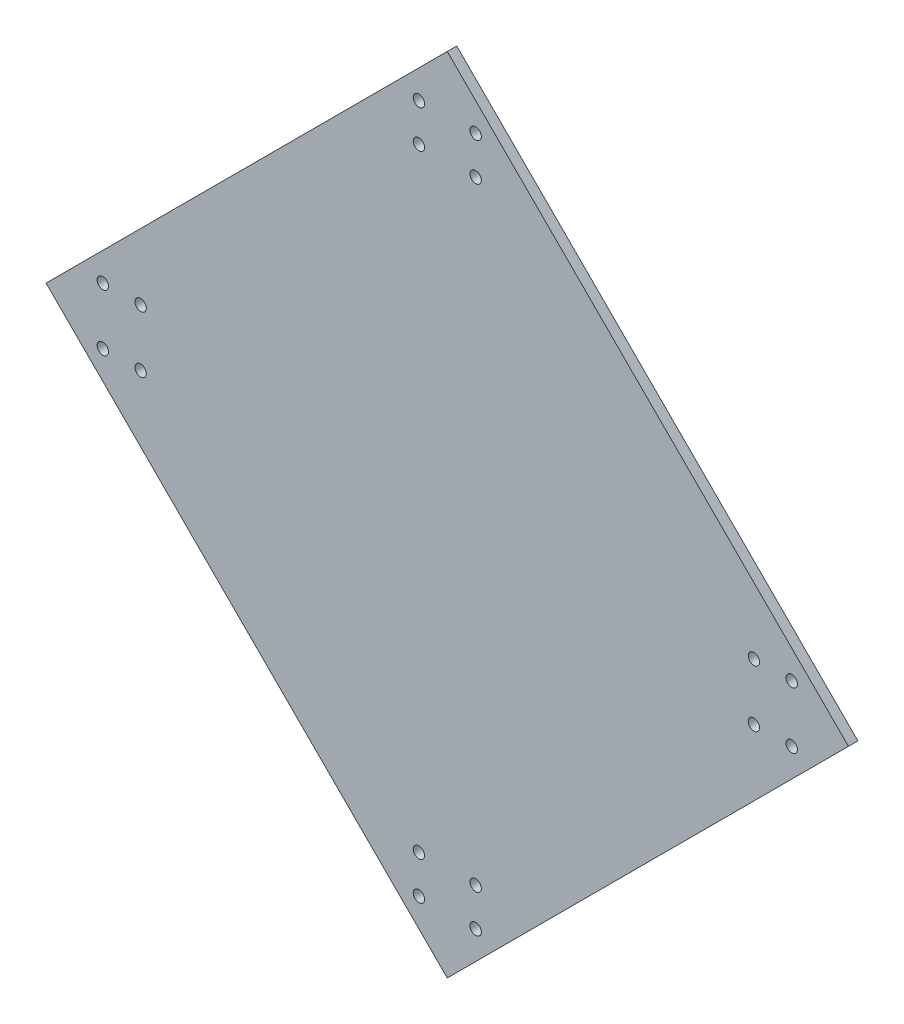
ISO-10303-21;
HEADER;
FILE_DESCRIPTION(('STEP AP214'),'2;1');
FILE_NAME('part.step','',(''),(''),'','','');
FILE_SCHEMA(('AUTOMOTIVE_DESIGN { 1 0 10303 214 1 1 1 1 }'));
ENDSEC;
DATA;
#1=APPLICATION_CONTEXT('core data for automotive mechanical design processes');
#2=APPLICATION_PROTOCOL_DEFINITION('international standard','automotive_design',2000,#1);
#3=PRODUCT_CONTEXT('',#1,'mechanical');
#4=PRODUCT('Part','Part','',(#3));
#5=PRODUCT_RELATED_PRODUCT_CATEGORY('part','',(#4));
#6=PRODUCT_DEFINITION_FORMATION('','',#4);
#7=PRODUCT_DEFINITION_CONTEXT('part definition',#1,'design');
#8=PRODUCT_DEFINITION('design','',#6,#7);
#9=PRODUCT_DEFINITION_SHAPE('','',#8);
#10=(LENGTH_UNIT() NAMED_UNIT(*) SI_UNIT(.MILLI.,.METRE.));
#11=(NAMED_UNIT(*) PLANE_ANGLE_UNIT() SI_UNIT($,.RADIAN.));
#12=(NAMED_UNIT(*) SI_UNIT($,.STERADIAN.) SOLID_ANGLE_UNIT());
#13=UNCERTAINTY_MEASURE_WITH_UNIT(LENGTH_MEASURE(1.E-05),#10,'distance_accuracy_value','');
#14=(GEOMETRIC_REPRESENTATION_CONTEXT(3) GLOBAL_UNCERTAINTY_ASSIGNED_CONTEXT((#13)) GLOBAL_UNIT_ASSIGNED_CONTEXT((#10,
#11,#12)) REPRESENTATION_CONTEXT('',''));
#15=CARTESIAN_POINT('',(0.,0.,0.));
#16=DIRECTION('',(0.,0.,1.));
#17=DIRECTION('',(1.,0.,0.));
#18=AXIS2_PLACEMENT_3D('',#15,#16,#17);
#19=CARTESIAN_POINT('',(0.,0.,2.5));
#20=DIRECTION('',(0.,0.,-1.));
#21=DIRECTION('',(-1.,0.,0.));
#22=AXIS2_PLACEMENT_3D('',#19,#20,#21);
#23=PLANE('',#22);
#24=DIRECTION('',(0.707106781186549,-0.707106781186546,0.));
#25=VECTOR('',#24,1.);
#26=CARTESIAN_POINT('',(0.,0.,2.5));
#27=LINE('',#26,#25);
#28=CARTESIAN_POINT('',(-106.066017177982,106.066017177982,2.5));
#29=VERTEX_POINT('',#28);
#30=CARTESIAN_POINT('',(0.,0.,2.5));
#31=VERTEX_POINT('',#30);
#32=EDGE_CURVE('E92',#29,#31,#27,.T.);
#33=ORIENTED_EDGE('',*,*,#32,.T.);
#34=DIRECTION('',(0.707106781186546,0.707106781186549,0.));
#35=VECTOR('',#34,1.);
#36=CARTESIAN_POINT('',(0.,0.,2.5));
#37=LINE('',#36,#35);
#38=CARTESIAN_POINT('',(106.066017177982,106.066017177982,2.5));
#39=VERTEX_POINT('',#38);
#40=EDGE_CURVE('E87',#31,#39,#37,.T.);
#41=ORIENTED_EDGE('',*,*,#40,.T.);
#42=DIRECTION('',(-0.707106781186549,0.707106781186547,0.));
#43=VECTOR('',#42,1.);
#44=CARTESIAN_POINT('',(106.066017177982,106.066017177982,2.5));
#45=LINE('',#44,#43);
#46=CARTESIAN_POINT('',(-3.60822483003176E-13,212.132034355964,2.5));
#47=VERTEX_POINT('',#46);
#48=EDGE_CURVE('E90',#39,#47,#45,.T.);
#49=ORIENTED_EDGE('',*,*,#48,.T.);
#50=DIRECTION('',(-0.707106781186546,-0.707106781186549,0.));
#51=VECTOR('',#50,1.);
#52=CARTESIAN_POINT('',(-106.066017177982,106.066017177982,2.5));
#53=LINE('',#52,#51);
#54=EDGE_CURVE('E57',#47,#29,#53,.T.);
#55=ORIENTED_EDGE('',*,*,#54,.T.);
#56=EDGE_LOOP('',(#33,#41,#49,#55));
#57=FACE_BOUND('',#56,.T.);
#58=CARTESIAN_POINT('',(-7.5,197.132034355964,2.5));
#59=DIRECTION('',(0.,0.,1.));
#60=DIRECTION('',(1.,0.,0.));
#61=AXIS2_PLACEMENT_3D('',#58,#59,#60);
#62=CIRCLE('',#61,1.5);
#63=CARTESIAN_POINT('',(-6.,197.132034355964,2.5));
#64=VERTEX_POINT('',#63);
#65=EDGE_CURVE('E112',#64,#64,#62,.T.);
#66=ORIENTED_EDGE('',*,*,#65,.F.);
#67=EDGE_LOOP('',(#66));
#68=FACE_BOUND('',#67,.T.);
#69=CARTESIAN_POINT('',(7.5,197.132034355964,2.5));
#70=DIRECTION('',(0.,0.,1.));
#71=DIRECTION('',(1.,0.,0.));
#72=AXIS2_PLACEMENT_3D('',#69,#70,#71);
#73=CIRCLE('',#72,1.5);
#74=CARTESIAN_POINT('',(9.,197.132034355964,2.5));
#75=VERTEX_POINT('',#74);
#76=EDGE_CURVE('E134',#75,#75,#73,.T.);
#77=ORIENTED_EDGE('',*,*,#76,.F.);
#78=EDGE_LOOP('',(#77));
#79=FACE_BOUND('',#78,.T.);
#80=CARTESIAN_POINT('',(-7.5,187.132034355964,2.5));
#81=DIRECTION('',(0.,0.,1.));
#82=DIRECTION('',(1.,0.,0.));
#83=AXIS2_PLACEMENT_3D('',#80,#81,#82);
#84=CIRCLE('',#83,1.5);
#85=CARTESIAN_POINT('',(-6.,187.132034355964,2.5));
#86=VERTEX_POINT('',#85);
#87=EDGE_CURVE('E142',#86,#86,#84,.T.);
#88=ORIENTED_EDGE('',*,*,#87,.F.);
#89=EDGE_LOOP('',(#88));
#90=FACE_BOUND('',#89,.T.);
#91=CARTESIAN_POINT('',(7.5,187.132034355964,2.5));
#92=DIRECTION('',(0.,0.,1.));
#93=DIRECTION('',(1.,0.,0.));
#94=AXIS2_PLACEMENT_3D('',#91,#92,#93);
#95=CIRCLE('',#94,1.5);
#96=CARTESIAN_POINT('',(9.00000000000001,187.132034355964,2.5));
#97=VERTEX_POINT('',#96);
#98=EDGE_CURVE('E150',#97,#97,#95,.T.);
#99=ORIENTED_EDGE('',*,*,#98,.F.);
#100=EDGE_LOOP('',(#99));
#101=FACE_BOUND('',#100,.T.);
#102=CARTESIAN_POINT('',(91.0660193559905,113.566015000026,2.5));
#103=DIRECTION('',(0.,0.,1.));
#104=DIRECTION('',(1.,0.,0.));
#105=AXIS2_PLACEMENT_3D('',#102,#103,#104);
#106=CIRCLE('',#105,1.5);
#107=CARTESIAN_POINT('',(92.5660193559905,113.566015000026,2.5));
#108=VERTEX_POINT('',#107);
#109=EDGE_CURVE('E158',#108,#108,#106,.T.);
#110=ORIENTED_EDGE('',*,*,#109,.F.);
#111=EDGE_LOOP('',(#110));
#112=FACE_BOUND('',#111,.T.);
#113=CARTESIAN_POINT('',(91.0660193559905,98.5660150000263,2.5));
#114=DIRECTION('',(0.,0.,1.));
#115=DIRECTION('',(1.,0.,0.));
#116=AXIS2_PLACEMENT_3D('',#113,#114,#115);
#117=CIRCLE('',#116,1.50000000000001);
#118=CARTESIAN_POINT('',(92.5660193559905,98.5660150000263,2.5));
#119=VERTEX_POINT('',#118);
#120=EDGE_CURVE('E166',#119,#119,#117,.T.);
#121=ORIENTED_EDGE('',*,*,#120,.F.);
#122=EDGE_LOOP('',(#121));
#123=FACE_BOUND('',#122,.T.);
#124=CARTESIAN_POINT('',(81.0660193559905,113.566015000026,2.5));
#125=DIRECTION('',(0.,0.,1.));
#126=DIRECTION('',(1.,0.,0.));
#127=AXIS2_PLACEMENT_3D('',#124,#125,#126);
#128=CIRCLE('',#127,1.5);
#129=CARTESIAN_POINT('',(82.5660193559905,113.566015000026,2.5));
#130=VERTEX_POINT('',#129);
#131=EDGE_CURVE('E174',#130,#130,#128,.T.);
#132=ORIENTED_EDGE('',*,*,#131,.F.);
#133=EDGE_LOOP('',(#132));
#134=FACE_BOUND('',#133,.T.);
#135=CARTESIAN_POINT('',(81.0660193559905,98.5660150000263,2.5));
#136=DIRECTION('',(0.,0.,1.));
#137=DIRECTION('',(1.,0.,0.));
#138=AXIS2_PLACEMENT_3D('',#135,#136,#137);
#139=CIRCLE('',#138,1.5);
#140=CARTESIAN_POINT('',(82.5660193559905,98.5660150000263,2.5));
#141=VERTEX_POINT('',#140);
#142=EDGE_CURVE('E182',#141,#141,#139,.T.);
#143=ORIENTED_EDGE('',*,*,#142,.F.);
#144=EDGE_LOOP('',(#143));
#145=FACE_BOUND('',#144,.T.);
#146=CARTESIAN_POINT('',(7.50000000005211,14.999995644036,2.5));
#147=DIRECTION('',(0.,0.,1.));
#148=DIRECTION('',(1.,0.,0.));
#149=AXIS2_PLACEMENT_3D('',#146,#147,#148);
#150=CIRCLE('',#149,1.5);
#151=CARTESIAN_POINT('',(9.00000000005211,14.999995644036,2.5));
#152=VERTEX_POINT('',#151);
#153=EDGE_CURVE('E190',#152,#152,#150,.T.);
#154=ORIENTED_EDGE('',*,*,#153,.F.);
#155=EDGE_LOOP('',(#154));
#156=FACE_BOUND('',#155,.T.);
#157=CARTESIAN_POINT('',(-7.49999999994789,14.9999956440361,2.5));
#158=DIRECTION('',(0.,0.,1.));
#159=DIRECTION('',(1.,0.,0.));
#160=AXIS2_PLACEMENT_3D('',#157,#158,#159);
#161=CIRCLE('',#160,1.5);
#162=CARTESIAN_POINT('',(-5.99999999994788,14.9999956440361,2.5));
#163=VERTEX_POINT('',#162);
#164=EDGE_CURVE('E198',#163,#163,#161,.T.);
#165=ORIENTED_EDGE('',*,*,#164,.F.);
#166=EDGE_LOOP('',(#165));
#167=FACE_BOUND('',#166,.T.);
#168=CARTESIAN_POINT('',(7.50000000005218,24.999995644036,2.5));
#169=DIRECTION('',(0.,0.,1.));
#170=DIRECTION('',(1.,0.,0.));
#171=AXIS2_PLACEMENT_3D('',#168,#169,#170);
#172=CIRCLE('',#171,1.5);
#173=CARTESIAN_POINT('',(9.00000000005218,24.999995644036,2.5));
#174=VERTEX_POINT('',#173);
#175=EDGE_CURVE('E206',#174,#174,#172,.T.);
#176=ORIENTED_EDGE('',*,*,#175,.F.);
#177=EDGE_LOOP('',(#176));
#178=FACE_BOUND('',#177,.T.);
#179=CARTESIAN_POINT('',(-7.49999999994782,24.9999956440361,2.5));
#180=DIRECTION('',(0.,0.,1.));
#181=DIRECTION('',(1.,0.,0.));
#182=AXIS2_PLACEMENT_3D('',#179,#180,#181);
#183=CIRCLE('',#182,1.5);
#184=CARTESIAN_POINT('',(-5.99999999994782,24.9999956440361,2.5));
#185=VERTEX_POINT('',#184);
#186=EDGE_CURVE('E214',#185,#185,#183,.T.);
#187=ORIENTED_EDGE('',*,*,#186,.F.);
#188=EDGE_LOOP('',(#187));
#189=FACE_BOUND('',#188,.T.);
#190=CARTESIAN_POINT('',(-91.0660193559378,98.5660149999748,2.5));
#191=DIRECTION('',(0.,0.,1.));
#192=DIRECTION('',(1.,0.,0.));
#193=AXIS2_PLACEMENT_3D('',#190,#191,#192);
#194=CIRCLE('',#193,1.5);
#195=CARTESIAN_POINT('',(-89.5660193559378,98.5660149999748,2.5));
#196=VERTEX_POINT('',#195);
#197=EDGE_CURVE('E222',#196,#196,#194,.T.);
#198=ORIENTED_EDGE('',*,*,#197,.F.);
#199=EDGE_LOOP('',(#198));
#200=FACE_BOUND('',#199,.T.);
#201=CARTESIAN_POINT('',(-91.0660193559377,113.566014999975,2.5));
#202=DIRECTION('',(0.,0.,1.));
#203=DIRECTION('',(1.,0.,0.));
#204=AXIS2_PLACEMENT_3D('',#201,#202,#203);
#205=CIRCLE('',#204,1.50000000000001);
#206=CARTESIAN_POINT('',(-89.5660193559377,113.566014999975,2.5));
#207=VERTEX_POINT('',#206);
#208=EDGE_CURVE('E230',#207,#207,#205,.T.);
#209=ORIENTED_EDGE('',*,*,#208,.F.);
#210=EDGE_LOOP('',(#209));
#211=FACE_BOUND('',#210,.T.);
#212=CARTESIAN_POINT('',(-81.0660193559378,98.5660149999747,2.5));
#213=DIRECTION('',(0.,0.,1.));
#214=DIRECTION('',(1.,0.,0.));
#215=AXIS2_PLACEMENT_3D('',#212,#213,#214);
#216=CIRCLE('',#215,1.49999999999999);
#217=CARTESIAN_POINT('',(-79.5660193559379,98.5660149999747,2.5));
#218=VERTEX_POINT('',#217);
#219=EDGE_CURVE('E238',#218,#218,#216,.T.);
#220=ORIENTED_EDGE('',*,*,#219,.F.);
#221=EDGE_LOOP('',(#220));
#222=FACE_BOUND('',#221,.T.);
#223=CARTESIAN_POINT('',(-81.0660193559377,113.566014999975,2.5));
#224=DIRECTION('',(0.,0.,1.));
#225=DIRECTION('',(1.,0.,0.));
#226=AXIS2_PLACEMENT_3D('',#223,#224,#225);
#227=CIRCLE('',#226,1.50000000000001);
#228=CARTESIAN_POINT('',(-79.5660193559377,113.566014999975,2.5));
#229=VERTEX_POINT('',#228);
#230=EDGE_CURVE('E246',#229,#229,#227,.T.);
#231=ORIENTED_EDGE('',*,*,#230,.F.);
#232=EDGE_LOOP('',(#231));
#233=FACE_BOUND('',#232,.T.);
#234=ADVANCED_FACE('F39',(#57,#68,#79,#90,#101,#112,#123,#134,#145,#156,#167,#178,#189,#200,
#211,#222,#233),#23,.F.);
#235=CARTESIAN_POINT('',(0.,0.,0.));
#236=DIRECTION('',(0.,0.,-1.));
#237=DIRECTION('',(-1.,0.,0.));
#238=AXIS2_PLACEMENT_3D('',#235,#236,#237);
#239=PLANE('',#238);
#240=CARTESIAN_POINT('',(-81.0660193559378,98.5660149999747,0.));
#241=DIRECTION('',(0.,0.,1.));
#242=DIRECTION('',(1.,0.,0.));
#243=AXIS2_PLACEMENT_3D('',#240,#241,#242);
#244=CIRCLE('',#243,1.49999999999999);
#245=CARTESIAN_POINT('',(-79.5660193559379,98.5660149999747,0.));
#246=VERTEX_POINT('',#245);
#247=EDGE_CURVE('E242',#246,#246,#244,.T.);
#248=ORIENTED_EDGE('',*,*,#247,.T.);
#249=EDGE_LOOP('',(#248));
#250=FACE_BOUND('',#249,.T.);
#251=CARTESIAN_POINT('',(-91.0660193559378,98.5660149999748,0.));
#252=DIRECTION('',(0.,0.,1.));
#253=DIRECTION('',(1.,0.,0.));
#254=AXIS2_PLACEMENT_3D('',#251,#252,#253);
#255=CIRCLE('',#254,1.5);
#256=CARTESIAN_POINT('',(-89.5660193559378,98.5660149999748,0.));
#257=VERTEX_POINT('',#256);
#258=EDGE_CURVE('E226',#257,#257,#255,.T.);
#259=ORIENTED_EDGE('',*,*,#258,.T.);
#260=EDGE_LOOP('',(#259));
#261=FACE_BOUND('',#260,.T.);
#262=CARTESIAN_POINT('',(7.50000000005218,24.999995644036,0.));
#263=DIRECTION('',(0.,0.,1.));
#264=DIRECTION('',(1.,0.,0.));
#265=AXIS2_PLACEMENT_3D('',#262,#263,#264);
#266=CIRCLE('',#265,1.5);
#267=CARTESIAN_POINT('',(9.00000000005218,24.999995644036,0.));
#268=VERTEX_POINT('',#267);
#269=EDGE_CURVE('E210',#268,#268,#266,.T.);
#270=ORIENTED_EDGE('',*,*,#269,.T.);
#271=EDGE_LOOP('',(#270));
#272=FACE_BOUND('',#271,.T.);
#273=CARTESIAN_POINT('',(7.50000000005211,14.999995644036,0.));
#274=DIRECTION('',(0.,0.,1.));
#275=DIRECTION('',(1.,0.,0.));
#276=AXIS2_PLACEMENT_3D('',#273,#274,#275);
#277=CIRCLE('',#276,1.5);
#278=CARTESIAN_POINT('',(9.00000000005211,14.999995644036,0.));
#279=VERTEX_POINT('',#278);
#280=EDGE_CURVE('E194',#279,#279,#277,.T.);
#281=ORIENTED_EDGE('',*,*,#280,.T.);
#282=EDGE_LOOP('',(#281));
#283=FACE_BOUND('',#282,.T.);
#284=CARTESIAN_POINT('',(81.0660193559905,113.566015000026,0.));
#285=DIRECTION('',(0.,0.,1.));
#286=DIRECTION('',(1.,0.,0.));
#287=AXIS2_PLACEMENT_3D('',#284,#285,#286);
#288=CIRCLE('',#287,1.5);
#289=CARTESIAN_POINT('',(82.5660193559905,113.566015000026,0.));
#290=VERTEX_POINT('',#289);
#291=EDGE_CURVE('E178',#290,#290,#288,.T.);
#292=ORIENTED_EDGE('',*,*,#291,.T.);
#293=EDGE_LOOP('',(#292));
#294=FACE_BOUND('',#293,.T.);
#295=CARTESIAN_POINT('',(91.0660193559905,113.566015000026,0.));
#296=DIRECTION('',(0.,0.,1.));
#297=DIRECTION('',(1.,0.,0.));
#298=AXIS2_PLACEMENT_3D('',#295,#296,#297);
#299=CIRCLE('',#298,1.5);
#300=CARTESIAN_POINT('',(92.5660193559905,113.566015000026,0.));
#301=VERTEX_POINT('',#300);
#302=EDGE_CURVE('E162',#301,#301,#299,.T.);
#303=ORIENTED_EDGE('',*,*,#302,.T.);
#304=EDGE_LOOP('',(#303));
#305=FACE_BOUND('',#304,.T.);
#306=CARTESIAN_POINT('',(-7.5,187.132034355964,0.));
#307=DIRECTION('',(0.,0.,1.));
#308=DIRECTION('',(1.,0.,0.));
#309=AXIS2_PLACEMENT_3D('',#306,#307,#308);
#310=CIRCLE('',#309,1.5);
#311=CARTESIAN_POINT('',(-6.,187.132034355964,0.));
#312=VERTEX_POINT('',#311);
#313=EDGE_CURVE('E146',#312,#312,#310,.T.);
#314=ORIENTED_EDGE('',*,*,#313,.T.);
#315=EDGE_LOOP('',(#314));
#316=FACE_BOUND('',#315,.T.);
#317=CARTESIAN_POINT('',(-7.5,197.132034355964,0.));
#318=DIRECTION('',(0.,0.,1.));
#319=DIRECTION('',(1.,0.,0.));
#320=AXIS2_PLACEMENT_3D('',#317,#318,#319);
#321=CIRCLE('',#320,1.5);
#322=CARTESIAN_POINT('',(-6.,197.132034355964,0.));
#323=VERTEX_POINT('',#322);
#324=EDGE_CURVE('E130',#323,#323,#321,.T.);
#325=ORIENTED_EDGE('',*,*,#324,.T.);
#326=EDGE_LOOP('',(#325));
#327=FACE_BOUND('',#326,.T.);
#328=DIRECTION('',(0.707106781186549,-0.707106781186546,0.));
#329=VECTOR('',#328,1.);
#330=CARTESIAN_POINT('',(0.,0.,0.));
#331=LINE('',#330,#329);
#332=CARTESIAN_POINT('',(-106.066017177982,106.066017177982,0.));
#333=VERTEX_POINT('',#332);
#334=CARTESIAN_POINT('',(0.,0.,0.));
#335=VERTEX_POINT('',#334);
#336=EDGE_CURVE('E108',#333,#335,#331,.T.);
#337=ORIENTED_EDGE('',*,*,#336,.F.);
#338=DIRECTION('',(-0.707106781186546,-0.707106781186549,0.));
#339=VECTOR('',#338,1.);
#340=CARTESIAN_POINT('',(-106.066017177982,106.066017177982,0.));
#341=LINE('',#340,#339);
#342=CARTESIAN_POINT('',(-3.60822483003176E-13,212.132034355964,0.));
#343=VERTEX_POINT('',#342);
#344=EDGE_CURVE('E80',#343,#333,#341,.T.);
#345=ORIENTED_EDGE('',*,*,#344,.F.);
#346=DIRECTION('',(-0.707106781186549,0.707106781186547,0.));
#347=VECTOR('',#346,1.);
#348=CARTESIAN_POINT('',(106.066017177982,106.066017177982,0.));
#349=LINE('',#348,#347);
#350=CARTESIAN_POINT('',(106.066017177982,106.066017177982,0.));
#351=VERTEX_POINT('',#350);
#352=EDGE_CURVE('E74',#351,#343,#349,.T.);
#353=ORIENTED_EDGE('',*,*,#352,.F.);
#354=DIRECTION('',(0.707106781186546,0.707106781186549,0.));
#355=VECTOR('',#354,1.);
#356=CARTESIAN_POINT('',(0.,0.,0.));
#357=LINE('',#356,#355);
#358=EDGE_CURVE('E97',#335,#351,#357,.T.);
#359=ORIENTED_EDGE('',*,*,#358,.F.);
#360=EDGE_LOOP('',(#337,#345,#353,#359));
#361=FACE_BOUND('',#360,.T.);
#362=CARTESIAN_POINT('',(7.5,197.132034355964,0.));
#363=DIRECTION('',(0.,0.,1.));
#364=DIRECTION('',(1.,0.,0.));
#365=AXIS2_PLACEMENT_3D('',#362,#363,#364);
#366=CIRCLE('',#365,1.5);
#367=CARTESIAN_POINT('',(9.,197.132034355964,0.));
#368=VERTEX_POINT('',#367);
#369=EDGE_CURVE('E138',#368,#368,#366,.T.);
#370=ORIENTED_EDGE('',*,*,#369,.T.);
#371=EDGE_LOOP('',(#370));
#372=FACE_BOUND('',#371,.T.);
#373=CARTESIAN_POINT('',(7.5,187.132034355964,0.));
#374=DIRECTION('',(0.,0.,1.));
#375=DIRECTION('',(1.,0.,0.));
#376=AXIS2_PLACEMENT_3D('',#373,#374,#375);
#377=CIRCLE('',#376,1.5);
#378=CARTESIAN_POINT('',(9.00000000000001,187.132034355964,0.));
#379=VERTEX_POINT('',#378);
#380=EDGE_CURVE('E154',#379,#379,#377,.T.);
#381=ORIENTED_EDGE('',*,*,#380,.T.);
#382=EDGE_LOOP('',(#381));
#383=FACE_BOUND('',#382,.T.);
#384=CARTESIAN_POINT('',(91.0660193559905,98.5660150000263,0.));
#385=DIRECTION('',(0.,0.,1.));
#386=DIRECTION('',(1.,0.,0.));
#387=AXIS2_PLACEMENT_3D('',#384,#385,#386);
#388=CIRCLE('',#387,1.50000000000001);
#389=CARTESIAN_POINT('',(92.5660193559905,98.5660150000263,0.));
#390=VERTEX_POINT('',#389);
#391=EDGE_CURVE('E170',#390,#390,#388,.T.);
#392=ORIENTED_EDGE('',*,*,#391,.T.);
#393=EDGE_LOOP('',(#392));
#394=FACE_BOUND('',#393,.T.);
#395=CARTESIAN_POINT('',(81.0660193559905,98.5660150000263,0.));
#396=DIRECTION('',(0.,0.,1.));
#397=DIRECTION('',(1.,0.,0.));
#398=AXIS2_PLACEMENT_3D('',#395,#396,#397);
#399=CIRCLE('',#398,1.5);
#400=CARTESIAN_POINT('',(82.5660193559905,98.5660150000263,0.));
#401=VERTEX_POINT('',#400);
#402=EDGE_CURVE('E186',#401,#401,#399,.T.);
#403=ORIENTED_EDGE('',*,*,#402,.T.);
#404=EDGE_LOOP('',(#403));
#405=FACE_BOUND('',#404,.T.);
#406=CARTESIAN_POINT('',(-7.49999999994789,14.9999956440361,0.));
#407=DIRECTION('',(0.,0.,1.));
#408=DIRECTION('',(1.,0.,0.));
#409=AXIS2_PLACEMENT_3D('',#406,#407,#408);
#410=CIRCLE('',#409,1.5);
#411=CARTESIAN_POINT('',(-5.99999999994788,14.9999956440361,0.));
#412=VERTEX_POINT('',#411);
#413=EDGE_CURVE('E202',#412,#412,#410,.T.);
#414=ORIENTED_EDGE('',*,*,#413,.T.);
#415=EDGE_LOOP('',(#414));
#416=FACE_BOUND('',#415,.T.);
#417=CARTESIAN_POINT('',(-7.49999999994782,24.9999956440361,0.));
#418=DIRECTION('',(0.,0.,1.));
#419=DIRECTION('',(1.,0.,0.));
#420=AXIS2_PLACEMENT_3D('',#417,#418,#419);
#421=CIRCLE('',#420,1.5);
#422=CARTESIAN_POINT('',(-5.99999999994782,24.9999956440361,0.));
#423=VERTEX_POINT('',#422);
#424=EDGE_CURVE('E218',#423,#423,#421,.T.);
#425=ORIENTED_EDGE('',*,*,#424,.T.);
#426=EDGE_LOOP('',(#425));
#427=FACE_BOUND('',#426,.T.);
#428=CARTESIAN_POINT('',(-91.0660193559377,113.566014999975,0.));
#429=DIRECTION('',(0.,0.,1.));
#430=DIRECTION('',(1.,0.,0.));
#431=AXIS2_PLACEMENT_3D('',#428,#429,#430);
#432=CIRCLE('',#431,1.50000000000001);
#433=CARTESIAN_POINT('',(-89.5660193559377,113.566014999975,0.));
#434=VERTEX_POINT('',#433);
#435=EDGE_CURVE('E234',#434,#434,#432,.T.);
#436=ORIENTED_EDGE('',*,*,#435,.T.);
#437=EDGE_LOOP('',(#436));
#438=FACE_BOUND('',#437,.T.);
#439=CARTESIAN_POINT('',(-81.0660193559377,113.566014999975,0.));
#440=DIRECTION('',(0.,0.,1.));
#441=DIRECTION('',(1.,0.,0.));
#442=AXIS2_PLACEMENT_3D('',#439,#440,#441);
#443=CIRCLE('',#442,1.50000000000001);
#444=CARTESIAN_POINT('',(-79.5660193559377,113.566014999975,0.));
#445=VERTEX_POINT('',#444);
#446=EDGE_CURVE('E250',#445,#445,#443,.T.);
#447=ORIENTED_EDGE('',*,*,#446,.T.);
#448=EDGE_LOOP('',(#447));
#449=FACE_BOUND('',#448,.T.);
#450=ADVANCED_FACE('F125',(#250,#261,#272,#283,#294,#305,#316,#327,#361,#372,#383,#394,#405,
#416,#427,#438,#449),#239,.T.);
#451=CARTESIAN_POINT('',(0.,0.,2.5));
#452=DIRECTION('',(0.707106781186546,0.707106781186549,0.));
#453=DIRECTION('',(-0.707106781186549,0.707106781186546,0.));
#454=AXIS2_PLACEMENT_3D('',#451,#452,#453);
#455=PLANE('',#454);
#456=ORIENTED_EDGE('',*,*,#336,.T.);
#457=DIRECTION('',(0.,0.,-1.));
#458=VECTOR('',#457,1.);
#459=CARTESIAN_POINT('',(0.,0.,2.5));
#460=LINE('',#459,#458);
#461=EDGE_CURVE('E11',#31,#335,#460,.T.);
#462=ORIENTED_EDGE('',*,*,#461,.F.);
#463=ORIENTED_EDGE('',*,*,#32,.F.);
#464=DIRECTION('',(0.,0.,-1.));
#465=VECTOR('',#464,1.);
#466=CARTESIAN_POINT('',(-106.066017177982,106.066017177982,2.5));
#467=LINE('',#466,#465);
#468=EDGE_CURVE('E104',#29,#333,#467,.T.);
#469=ORIENTED_EDGE('',*,*,#468,.T.);
#470=EDGE_LOOP('',(#456,#462,#463,#469));
#471=FACE_BOUND('',#470,.T.);
#472=ADVANCED_FACE('F41',(#471),#455,.F.);
#473=CARTESIAN_POINT('',(0.,0.,2.5));
#474=DIRECTION('',(-0.707106781186549,0.707106781186546,0.));
#475=DIRECTION('',(-0.707106781186546,-0.707106781186549,0.));
#476=AXIS2_PLACEMENT_3D('',#473,#474,#475);
#477=PLANE('',#476);
#478=ORIENTED_EDGE('',*,*,#358,.T.);
#479=DIRECTION('',(0.,0.,-1.));
#480=VECTOR('',#479,1.);
#481=CARTESIAN_POINT('',(106.066017177982,106.066017177982,2.5));
#482=LINE('',#481,#480);
#483=EDGE_CURVE('E49',#39,#351,#482,.T.);
#484=ORIENTED_EDGE('',*,*,#483,.F.);
#485=ORIENTED_EDGE('',*,*,#40,.F.);
#486=ORIENTED_EDGE('',*,*,#461,.T.);
#487=EDGE_LOOP('',(#478,#484,#485,#486));
#488=FACE_BOUND('',#487,.T.);
#489=ADVANCED_FACE('F96',(#488),#477,.F.);
#490=CARTESIAN_POINT('',(106.066017177982,106.066017177982,2.5));
#491=DIRECTION('',(-0.707106781186547,-0.707106781186549,0.));
#492=DIRECTION('',(0.707106781186549,-0.707106781186546,0.));
#493=AXIS2_PLACEMENT_3D('',#490,#491,#492);
#494=PLANE('',#493);
#495=ORIENTED_EDGE('',*,*,#352,.T.);
#496=DIRECTION('',(0.,0.,-1.));
#497=VECTOR('',#496,1.);
#498=CARTESIAN_POINT('',(-3.60822483003176E-13,212.132034355964,2.5));
#499=LINE('',#498,#497);
#500=EDGE_CURVE('E99',#47,#343,#499,.T.);
#501=ORIENTED_EDGE('',*,*,#500,.F.);
#502=ORIENTED_EDGE('',*,*,#48,.F.);
#503=ORIENTED_EDGE('',*,*,#483,.T.);
#504=EDGE_LOOP('',(#495,#501,#502,#503));
#505=FACE_BOUND('',#504,.T.);
#506=ADVANCED_FACE('F100',(#505),#494,.F.);
#507=CARTESIAN_POINT('',(-106.066017177982,106.066017177982,2.5));
#508=DIRECTION('',(0.707106781186549,-0.707106781186546,0.));
#509=DIRECTION('',(0.707106781186546,0.707106781186549,0.));
#510=AXIS2_PLACEMENT_3D('',#507,#508,#509);
#511=PLANE('',#510);
#512=ORIENTED_EDGE('',*,*,#344,.T.);
#513=ORIENTED_EDGE('',*,*,#468,.F.);
#514=ORIENTED_EDGE('',*,*,#54,.F.);
#515=ORIENTED_EDGE('',*,*,#500,.T.);
#516=EDGE_LOOP('',(#512,#513,#514,#515));
#517=FACE_BOUND('',#516,.T.);
#518=ADVANCED_FACE('F122',(#517),#511,.F.);
#519=CARTESIAN_POINT('',(-7.5,197.132034355964,2.5));
#520=DIRECTION('',(0.,0.,-1.));
#521=DIRECTION('',(-1.,0.,0.));
#522=AXIS2_PLACEMENT_3D('',#519,#520,#521);
#523=CYLINDRICAL_SURFACE('',#522,1.5);
#524=ORIENTED_EDGE('',*,*,#65,.T.);
#525=EDGE_LOOP('',(#524));
#526=FACE_BOUND('',#525,.T.);
#527=ORIENTED_EDGE('',*,*,#324,.F.);
#528=EDGE_LOOP('',(#527));
#529=FACE_BOUND('',#528,.T.);
#530=ADVANCED_FACE('F269',(#526,#529),#523,.F.);
#531=CARTESIAN_POINT('',(7.5,197.132034355964,2.5));
#532=DIRECTION('',(0.,0.,-1.));
#533=DIRECTION('',(-1.,0.,0.));
#534=AXIS2_PLACEMENT_3D('',#531,#532,#533);
#535=CYLINDRICAL_SURFACE('',#534,1.5);
#536=ORIENTED_EDGE('',*,*,#76,.T.);
#537=EDGE_LOOP('',(#536));
#538=FACE_BOUND('',#537,.T.);
#539=ORIENTED_EDGE('',*,*,#369,.F.);
#540=EDGE_LOOP('',(#539));
#541=FACE_BOUND('',#540,.T.);
#542=ADVANCED_FACE('F315',(#538,#541),#535,.F.);
#543=CARTESIAN_POINT('',(-7.5,187.132034355964,2.5));
#544=DIRECTION('',(0.,0.,-1.));
#545=DIRECTION('',(-1.,0.,0.));
#546=AXIS2_PLACEMENT_3D('',#543,#544,#545);
#547=CYLINDRICAL_SURFACE('',#546,1.5);
#548=ORIENTED_EDGE('',*,*,#87,.T.);
#549=EDGE_LOOP('',(#548));
#550=FACE_BOUND('',#549,.T.);
#551=ORIENTED_EDGE('',*,*,#313,.F.);
#552=EDGE_LOOP('',(#551));
#553=FACE_BOUND('',#552,.T.);
#554=ADVANCED_FACE('F323',(#550,#553),#547,.F.);
#555=CARTESIAN_POINT('',(7.5,187.132034355964,2.5));
#556=DIRECTION('',(0.,0.,-1.));
#557=DIRECTION('',(-1.,0.,0.));
#558=AXIS2_PLACEMENT_3D('',#555,#556,#557);
#559=CYLINDRICAL_SURFACE('',#558,1.5);
#560=ORIENTED_EDGE('',*,*,#98,.T.);
#561=EDGE_LOOP('',(#560));
#562=FACE_BOUND('',#561,.T.);
#563=ORIENTED_EDGE('',*,*,#380,.F.);
#564=EDGE_LOOP('',(#563));
#565=FACE_BOUND('',#564,.T.);
#566=ADVANCED_FACE('F331',(#562,#565),#559,.F.);
#567=CARTESIAN_POINT('',(91.0660193559905,113.566015000026,2.5));
#568=DIRECTION('',(0.,0.,-1.));
#569=DIRECTION('',(-1.,0.,0.));
#570=AXIS2_PLACEMENT_3D('',#567,#568,#569);
#571=CYLINDRICAL_SURFACE('',#570,1.5);
#572=ORIENTED_EDGE('',*,*,#109,.T.);
#573=EDGE_LOOP('',(#572));
#574=FACE_BOUND('',#573,.T.);
#575=ORIENTED_EDGE('',*,*,#302,.F.);
#576=EDGE_LOOP('',(#575));
#577=FACE_BOUND('',#576,.T.);
#578=ADVANCED_FACE('F340',(#574,#577),#571,.F.);
#579=CARTESIAN_POINT('',(91.0660193559905,98.5660150000263,2.5));
#580=DIRECTION('',(0.,0.,-1.));
#581=DIRECTION('',(-1.,0.,0.));
#582=AXIS2_PLACEMENT_3D('',#579,#580,#581);
#583=CYLINDRICAL_SURFACE('',#582,1.50000000000001);
#584=ORIENTED_EDGE('',*,*,#120,.T.);
#585=EDGE_LOOP('',(#584));
#586=FACE_BOUND('',#585,.T.);
#587=ORIENTED_EDGE('',*,*,#391,.F.);
#588=EDGE_LOOP('',(#587));
#589=FACE_BOUND('',#588,.T.);
#590=ADVANCED_FACE('F349',(#586,#589),#583,.F.);
#591=CARTESIAN_POINT('',(81.0660193559905,113.566015000026,2.5));
#592=DIRECTION('',(0.,0.,-1.));
#593=DIRECTION('',(-1.,0.,0.));
#594=AXIS2_PLACEMENT_3D('',#591,#592,#593);
#595=CYLINDRICAL_SURFACE('',#594,1.5);
#596=ORIENTED_EDGE('',*,*,#131,.T.);
#597=EDGE_LOOP('',(#596));
#598=FACE_BOUND('',#597,.T.);
#599=ORIENTED_EDGE('',*,*,#291,.F.);
#600=EDGE_LOOP('',(#599));
#601=FACE_BOUND('',#600,.T.);
#602=ADVANCED_FACE('F358',(#598,#601),#595,.F.);
#603=CARTESIAN_POINT('',(81.0660193559905,98.5660150000263,2.5));
#604=DIRECTION('',(0.,0.,-1.));
#605=DIRECTION('',(-1.,0.,0.));
#606=AXIS2_PLACEMENT_3D('',#603,#604,#605);
#607=CYLINDRICAL_SURFACE('',#606,1.5);
#608=ORIENTED_EDGE('',*,*,#142,.T.);
#609=EDGE_LOOP('',(#608));
#610=FACE_BOUND('',#609,.T.);
#611=ORIENTED_EDGE('',*,*,#402,.F.);
#612=EDGE_LOOP('',(#611));
#613=FACE_BOUND('',#612,.T.);
#614=ADVANCED_FACE('F367',(#610,#613),#607,.F.);
#615=CARTESIAN_POINT('',(7.50000000005211,14.999995644036,2.5));
#616=DIRECTION('',(0.,0.,-1.));
#617=DIRECTION('',(-1.,0.,0.));
#618=AXIS2_PLACEMENT_3D('',#615,#616,#617);
#619=CYLINDRICAL_SURFACE('',#618,1.5);
#620=ORIENTED_EDGE('',*,*,#153,.T.);
#621=EDGE_LOOP('',(#620));
#622=FACE_BOUND('',#621,.T.);
#623=ORIENTED_EDGE('',*,*,#280,.F.);
#624=EDGE_LOOP('',(#623));
#625=FACE_BOUND('',#624,.T.);
#626=ADVANCED_FACE('F376',(#622,#625),#619,.F.);
#627=CARTESIAN_POINT('',(-7.49999999994789,14.9999956440361,2.5));
#628=DIRECTION('',(0.,0.,-1.));
#629=DIRECTION('',(-1.,0.,0.));
#630=AXIS2_PLACEMENT_3D('',#627,#628,#629);
#631=CYLINDRICAL_SURFACE('',#630,1.5);
#632=ORIENTED_EDGE('',*,*,#164,.T.);
#633=EDGE_LOOP('',(#632));
#634=FACE_BOUND('',#633,.T.);
#635=ORIENTED_EDGE('',*,*,#413,.F.);
#636=EDGE_LOOP('',(#635));
#637=FACE_BOUND('',#636,.T.);
#638=ADVANCED_FACE('F385',(#634,#637),#631,.F.);
#639=CARTESIAN_POINT('',(7.50000000005218,24.999995644036,2.5));
#640=DIRECTION('',(0.,0.,-1.));
#641=DIRECTION('',(-1.,0.,0.));
#642=AXIS2_PLACEMENT_3D('',#639,#640,#641);
#643=CYLINDRICAL_SURFACE('',#642,1.5);
#644=ORIENTED_EDGE('',*,*,#175,.T.);
#645=EDGE_LOOP('',(#644));
#646=FACE_BOUND('',#645,.T.);
#647=ORIENTED_EDGE('',*,*,#269,.F.);
#648=EDGE_LOOP('',(#647));
#649=FACE_BOUND('',#648,.T.);
#650=ADVANCED_FACE('F394',(#646,#649),#643,.F.);
#651=CARTESIAN_POINT('',(-7.49999999994782,24.9999956440361,2.5));
#652=DIRECTION('',(0.,0.,-1.));
#653=DIRECTION('',(-1.,0.,0.));
#654=AXIS2_PLACEMENT_3D('',#651,#652,#653);
#655=CYLINDRICAL_SURFACE('',#654,1.5);
#656=ORIENTED_EDGE('',*,*,#186,.T.);
#657=EDGE_LOOP('',(#656));
#658=FACE_BOUND('',#657,.T.);
#659=ORIENTED_EDGE('',*,*,#424,.F.);
#660=EDGE_LOOP('',(#659));
#661=FACE_BOUND('',#660,.T.);
#662=ADVANCED_FACE('F403',(#658,#661),#655,.F.);
#663=CARTESIAN_POINT('',(-91.0660193559378,98.5660149999748,2.5));
#664=DIRECTION('',(0.,0.,-1.));
#665=DIRECTION('',(-1.,0.,0.));
#666=AXIS2_PLACEMENT_3D('',#663,#664,#665);
#667=CYLINDRICAL_SURFACE('',#666,1.5);
#668=ORIENTED_EDGE('',*,*,#197,.T.);
#669=EDGE_LOOP('',(#668));
#670=FACE_BOUND('',#669,.T.);
#671=ORIENTED_EDGE('',*,*,#258,.F.);
#672=EDGE_LOOP('',(#671));
#673=FACE_BOUND('',#672,.T.);
#674=ADVANCED_FACE('F412',(#670,#673),#667,.F.);
#675=CARTESIAN_POINT('',(-91.0660193559377,113.566014999975,2.5));
#676=DIRECTION('',(0.,0.,-1.));
#677=DIRECTION('',(-1.,0.,0.));
#678=AXIS2_PLACEMENT_3D('',#675,#676,#677);
#679=CYLINDRICAL_SURFACE('',#678,1.50000000000001);
#680=ORIENTED_EDGE('',*,*,#208,.T.);
#681=EDGE_LOOP('',(#680));
#682=FACE_BOUND('',#681,.T.);
#683=ORIENTED_EDGE('',*,*,#435,.F.);
#684=EDGE_LOOP('',(#683));
#685=FACE_BOUND('',#684,.T.);
#686=ADVANCED_FACE('F421',(#682,#685),#679,.F.);
#687=CARTESIAN_POINT('',(-81.0660193559378,98.5660149999747,2.5));
#688=DIRECTION('',(0.,0.,-1.));
#689=DIRECTION('',(-1.,0.,0.));
#690=AXIS2_PLACEMENT_3D('',#687,#688,#689);
#691=CYLINDRICAL_SURFACE('',#690,1.49999999999999);
#692=ORIENTED_EDGE('',*,*,#219,.T.);
#693=EDGE_LOOP('',(#692));
#694=FACE_BOUND('',#693,.T.);
#695=ORIENTED_EDGE('',*,*,#247,.F.);
#696=EDGE_LOOP('',(#695));
#697=FACE_BOUND('',#696,.T.);
#698=ADVANCED_FACE('F430',(#694,#697),#691,.F.);
#699=CARTESIAN_POINT('',(-81.0660193559377,113.566014999975,2.5));
#700=DIRECTION('',(0.,0.,-1.));
#701=DIRECTION('',(-1.,0.,0.));
#702=AXIS2_PLACEMENT_3D('',#699,#700,#701);
#703=CYLINDRICAL_SURFACE('',#702,1.50000000000001);
#704=ORIENTED_EDGE('',*,*,#230,.T.);
#705=EDGE_LOOP('',(#704));
#706=FACE_BOUND('',#705,.T.);
#707=ORIENTED_EDGE('',*,*,#446,.F.);
#708=EDGE_LOOP('',(#707));
#709=FACE_BOUND('',#708,.T.);
#710=ADVANCED_FACE('F258',(#706,#709),#703,.F.);
#711=CLOSED_SHELL('',(#234,#450,#472,#489,#506,#518,#530,#542,#554,#566,#578,#590,#602,#614,
#626,#638,#650,#662,#674,#686,#698,#710));
#712=MANIFOLD_SOLID_BREP('B2',#711);
#713=ADVANCED_BREP_SHAPE_REPRESENTATION('',(#18,#712),#14);
#714=SHAPE_DEFINITION_REPRESENTATION(#9,#713);
ENDSEC;
END-ISO-10303-21;
